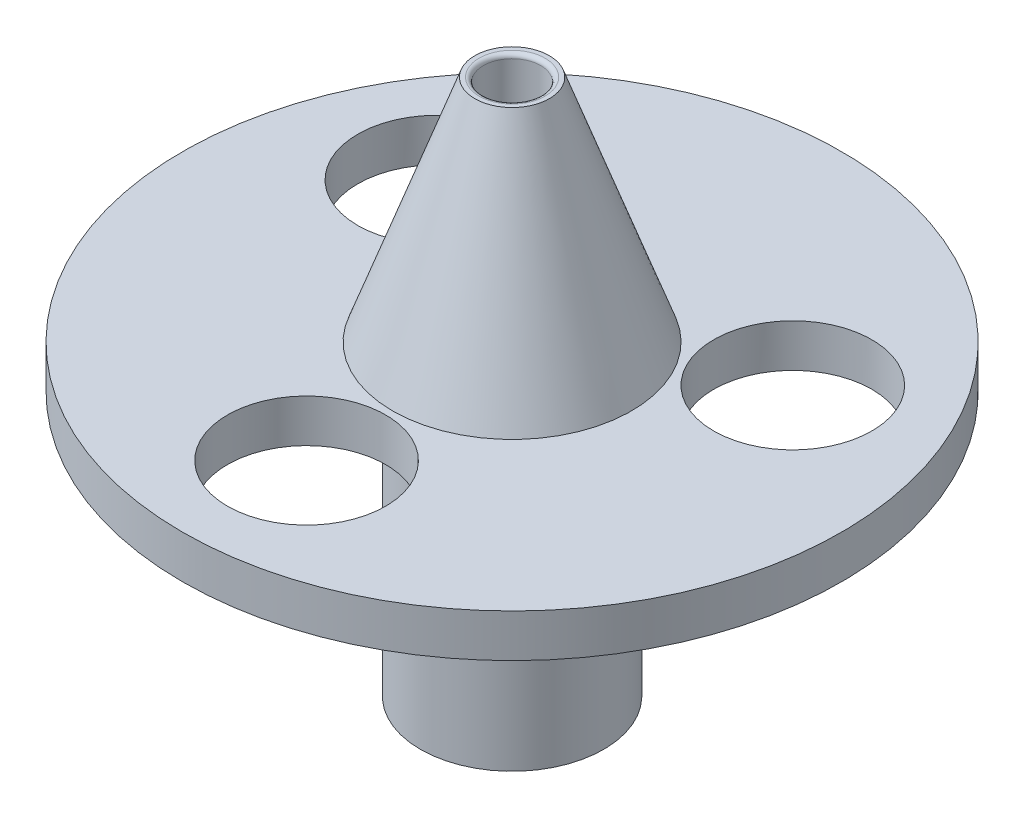
ISO-10303-21;
HEADER;
FILE_DESCRIPTION(('STEP AP214'),'2;1');
FILE_NAME('part.step','',(''),(''),'','','');
FILE_SCHEMA(('AUTOMOTIVE_DESIGN { 1 0 10303 214 1 1 1 1 }'));
ENDSEC;
DATA;
#1=APPLICATION_CONTEXT('core data for automotive mechanical design processes');
#2=APPLICATION_PROTOCOL_DEFINITION('international standard','automotive_design',2000,#1);
#3=PRODUCT_CONTEXT('',#1,'mechanical');
#4=PRODUCT('Part','Part','',(#3));
#5=PRODUCT_RELATED_PRODUCT_CATEGORY('part','',(#4));
#6=PRODUCT_DEFINITION_FORMATION('','',#4);
#7=PRODUCT_DEFINITION_CONTEXT('part definition',#1,'design');
#8=PRODUCT_DEFINITION('design','',#6,#7);
#9=PRODUCT_DEFINITION_SHAPE('','',#8);
#10=(LENGTH_UNIT() NAMED_UNIT(*) SI_UNIT(.MILLI.,.METRE.));
#11=(NAMED_UNIT(*) PLANE_ANGLE_UNIT() SI_UNIT($,.RADIAN.));
#12=(NAMED_UNIT(*) SI_UNIT($,.STERADIAN.) SOLID_ANGLE_UNIT());
#13=UNCERTAINTY_MEASURE_WITH_UNIT(LENGTH_MEASURE(1.E-05),#10,'distance_accuracy_value','');
#14=(GEOMETRIC_REPRESENTATION_CONTEXT(3) GLOBAL_UNCERTAINTY_ASSIGNED_CONTEXT((#13)) GLOBAL_UNIT_ASSIGNED_CONTEXT((#10,
#11,#12)) REPRESENTATION_CONTEXT('',''));
#15=CARTESIAN_POINT('',(0.,0.,0.));
#16=DIRECTION('',(0.,0.,1.));
#17=DIRECTION('',(1.,0.,0.));
#18=AXIS2_PLACEMENT_3D('',#15,#16,#17);
#19=CARTESIAN_POINT('',(8.34090211798037,-16.,0.));
#20=DIRECTION('',(0.,1.,0.));
#21=DIRECTION('',(0.,0.,1.));
#22=AXIS2_PLACEMENT_3D('',#19,#20,#21);
#23=PLANE('',#22);
#24=CARTESIAN_POINT('',(0.,-16.,14.34090212));
#25=DIRECTION('',(0.,1.,0.));
#26=DIRECTION('',(0.,0.,1.));
#27=AXIS2_PLACEMENT_3D('',#24,#25,#26);
#28=CIRCLE('',#27,5.52);
#29=CARTESIAN_POINT('',(0.,-16.,19.86090212));
#30=VERTEX_POINT('',#29);
#31=EDGE_CURVE('E230',#30,#30,#28,.T.);
#32=ORIENTED_EDGE('',*,*,#31,.F.);
#33=EDGE_LOOP('',(#32));
#34=FACE_BOUND('',#33,.T.);
#35=CARTESIAN_POINT('',(0.,-16.,0.));
#36=DIRECTION('',(0.,1.,0.));
#37=DIRECTION('',(0.,0.,1.));
#38=AXIS2_PLACEMENT_3D('',#35,#36,#37);
#39=CIRCLE('',#38,8.34090211798037);
#40=CARTESIAN_POINT('',(0.,-16.,8.34090211798037));
#41=VERTEX_POINT('',#40);
#42=EDGE_CURVE('E107',#41,#41,#39,.T.);
#43=ORIENTED_EDGE('',*,*,#42,.F.);
#44=EDGE_LOOP('',(#43));
#45=FACE_BOUND('',#44,.T.);
#46=CARTESIAN_POINT('',(0.,-16.,0.));
#47=DIRECTION('',(0.,1.,0.));
#48=DIRECTION('',(0.,0.,1.));
#49=AXIS2_PLACEMENT_3D('',#46,#47,#48);
#50=CIRCLE('',#49,23.);
#51=CARTESIAN_POINT('',(0.,-16.,23.));
#52=VERTEX_POINT('',#51);
#53=EDGE_CURVE('E93',#52,#52,#50,.T.);
#54=ORIENTED_EDGE('',*,*,#53,.T.);
#55=EDGE_LOOP('',(#54));
#56=FACE_BOUND('',#55,.T.);
#57=CARTESIAN_POINT('',(12.4195855473576,-16.,-7.170451058991));
#58=DIRECTION('',(0.,1.,0.));
#59=DIRECTION('',(0.,0.,1.));
#60=AXIS2_PLACEMENT_3D('',#57,#58,#59);
#61=CIRCLE('',#60,5.52000000000096);
#62=CARTESIAN_POINT('',(12.4195855473576,-16.,-1.65045105899004));
#63=VERTEX_POINT('',#62);
#64=EDGE_CURVE('E76',#63,#63,#61,.T.);
#65=ORIENTED_EDGE('',*,*,#64,.F.);
#66=EDGE_LOOP('',(#65));
#67=FACE_BOUND('',#66,.T.);
#68=CARTESIAN_POINT('',(-12.4195855473571,-16.,-7.17045105899019));
#69=DIRECTION('',(0.,1.,0.));
#70=DIRECTION('',(0.,0.,1.));
#71=AXIS2_PLACEMENT_3D('',#68,#69,#70);
#72=CIRCLE('',#71,5.52);
#73=CARTESIAN_POINT('',(-12.4195855473571,-16.,-1.65045105899019));
#74=VERTEX_POINT('',#73);
#75=EDGE_CURVE('E84',#74,#74,#72,.T.);
#76=ORIENTED_EDGE('',*,*,#75,.F.);
#77=EDGE_LOOP('',(#76));
#78=FACE_BOUND('',#77,.T.);
#79=ADVANCED_FACE('F55',(#34,#45,#56,#67,#78),#23,.T.);
#80=CARTESIAN_POINT('',(20.3409021179804,-19.,0.));
#81=DIRECTION('',(0.,-1.,0.));
#82=DIRECTION('',(0.,0.,-1.));
#83=AXIS2_PLACEMENT_3D('',#80,#81,#82);
#84=PLANE('',#83);
#85=CARTESIAN_POINT('',(0.,-19.,14.34090212));
#86=DIRECTION('',(0.,1.,0.));
#87=DIRECTION('',(0.,0.,1.));
#88=AXIS2_PLACEMENT_3D('',#85,#86,#87);
#89=CIRCLE('',#88,5.52);
#90=CARTESIAN_POINT('',(0.,-19.,19.86090212));
#91=VERTEX_POINT('',#90);
#92=EDGE_CURVE('E228',#91,#91,#89,.T.);
#93=ORIENTED_EDGE('',*,*,#92,.T.);
#94=EDGE_LOOP('',(#93));
#95=FACE_BOUND('',#94,.T.);
#96=CARTESIAN_POINT('',(0.,-19.,0.));
#97=DIRECTION('',(0.,1.,0.));
#98=DIRECTION('',(0.,0.,1.));
#99=AXIS2_PLACEMENT_3D('',#96,#97,#98);
#100=CIRCLE('',#99,23.);
#101=CARTESIAN_POINT('',(0.,-19.,23.));
#102=VERTEX_POINT('',#101);
#103=EDGE_CURVE('E90',#102,#102,#100,.T.);
#104=ORIENTED_EDGE('',*,*,#103,.F.);
#105=EDGE_LOOP('',(#104));
#106=FACE_BOUND('',#105,.T.);
#107=CARTESIAN_POINT('',(0.,-19.,0.));
#108=DIRECTION('',(0.,1.,0.));
#109=DIRECTION('',(0.,0.,1.));
#110=AXIS2_PLACEMENT_3D('',#107,#108,#109);
#111=CIRCLE('',#110,6.4);
#112=CARTESIAN_POINT('',(0.,-19.,6.4));
#113=VERTEX_POINT('',#112);
#114=EDGE_CURVE('E103',#113,#113,#111,.T.);
#115=ORIENTED_EDGE('',*,*,#114,.T.);
#116=EDGE_LOOP('',(#115));
#117=FACE_BOUND('',#116,.T.);
#118=CARTESIAN_POINT('',(12.4195855473576,-19.,-7.170451058991));
#119=DIRECTION('',(0.,-1.,0.));
#120=DIRECTION('',(0.,0.,-1.));
#121=AXIS2_PLACEMENT_3D('',#118,#119,#120);
#122=CIRCLE('',#121,5.52000000000096);
#123=CARTESIAN_POINT('',(12.4195855473576,-19.,-12.690451058992));
#124=VERTEX_POINT('',#123);
#125=EDGE_CURVE('E73',#124,#124,#122,.T.);
#126=ORIENTED_EDGE('',*,*,#125,.F.);
#127=EDGE_LOOP('',(#126));
#128=FACE_BOUND('',#127,.T.);
#129=CARTESIAN_POINT('',(-12.4195855473571,-19.,-7.17045105899019));
#130=DIRECTION('',(0.,-1.,0.));
#131=DIRECTION('',(0.,0.,-1.));
#132=AXIS2_PLACEMENT_3D('',#129,#130,#131);
#133=CIRCLE('',#132,5.52);
#134=CARTESIAN_POINT('',(-12.4195855473571,-19.,-12.6904510589902));
#135=VERTEX_POINT('',#134);
#136=EDGE_CURVE('E59',#135,#135,#133,.T.);
#137=ORIENTED_EDGE('',*,*,#136,.F.);
#138=EDGE_LOOP('',(#137));
#139=FACE_BOUND('',#138,.T.);
#140=ADVANCED_FACE('F152',(#95,#106,#117,#128,#139),#84,.T.);
#141=CARTESIAN_POINT('',(0.,0.,0.));
#142=DIRECTION('',(0.,1.,0.));
#143=DIRECTION('',(0.,0.,1.));
#144=AXIS2_PLACEMENT_3D('',#141,#142,#143);
#145=CYLINDRICAL_SURFACE('',#144,2.);
#146=CARTESIAN_POINT('',(0.,-14.9277526967274,0.));
#147=DIRECTION('',(0.,-1.,0.));
#148=DIRECTION('',(0.,0.,-1.));
#149=AXIS2_PLACEMENT_3D('',#146,#147,#148);
#150=CIRCLE('',#149,2.);
#151=CARTESIAN_POINT('',(0.,-14.9277526967274,-2.));
#152=VERTEX_POINT('',#151);
#153=EDGE_CURVE('E70',#152,#152,#150,.T.);
#154=ORIENTED_EDGE('',*,*,#153,.T.);
#155=EDGE_LOOP('',(#154));
#156=FACE_BOUND('',#155,.T.);
#157=CARTESIAN_POINT('',(0.,-0.3,0.));
#158=DIRECTION('',(0.,1.,0.));
#159=DIRECTION('',(0.,0.,1.));
#160=AXIS2_PLACEMENT_3D('',#157,#158,#159);
#161=CIRCLE('',#160,2.);
#162=CARTESIAN_POINT('',(0.,-0.3,2.));
#163=VERTEX_POINT('',#162);
#164=EDGE_CURVE('E115',#163,#163,#161,.T.);
#165=ORIENTED_EDGE('',*,*,#164,.T.);
#166=EDGE_LOOP('',(#165));
#167=FACE_BOUND('',#166,.T.);
#168=ADVANCED_FACE('F130',(#156,#167),#145,.F.);
#169=CARTESIAN_POINT('',(2.,0.,0.));
#170=DIRECTION('',(0.,1.,0.));
#171=DIRECTION('',(0.,0.,1.));
#172=AXIS2_PLACEMENT_3D('',#169,#170,#171);
#173=PLANE('',#172);
#174=CARTESIAN_POINT('',(0.,0.,0.));
#175=DIRECTION('',(0.,1.,0.));
#176=DIRECTION('',(0.,0.,1.));
#177=AXIS2_PLACEMENT_3D('',#174,#175,#176);
#178=CIRCLE('',#177,2.3);
#179=CARTESIAN_POINT('',(0.,0.,2.3));
#180=VERTEX_POINT('',#179);
#181=EDGE_CURVE('E119',#180,#180,#178,.F.);
#182=ORIENTED_EDGE('',*,*,#181,.T.);
#183=EDGE_LOOP('',(#182));
#184=FACE_BOUND('',#183,.T.);
#185=CARTESIAN_POINT('',(0.,0.,0.));
#186=DIRECTION('',(0.,1.,0.));
#187=DIRECTION('',(0.,0.,1.));
#188=AXIS2_PLACEMENT_3D('',#185,#186,#187);
#189=CIRCLE('',#188,2.6);
#190=CARTESIAN_POINT('',(0.,0.,2.6));
#191=VERTEX_POINT('',#190);
#192=EDGE_CURVE('E111',#191,#191,#189,.T.);
#193=ORIENTED_EDGE('',*,*,#192,.T.);
#194=EDGE_LOOP('',(#193));
#195=FACE_BOUND('',#194,.T.);
#196=ADVANCED_FACE('F169',(#184,#195),#173,.T.);
#197=CARTESIAN_POINT('',(0.,0.,0.));
#198=DIRECTION('',(0.,-1.,0.));
#199=DIRECTION('',(0.,0.,-1.));
#200=AXIS2_PLACEMENT_3D('',#197,#198,#199);
#201=CONICAL_SURFACE('',#200,2.6,0.344498506034037);
#202=ORIENTED_EDGE('',*,*,#42,.T.);
#203=EDGE_LOOP('',(#202));
#204=FACE_BOUND('',#203,.T.);
#205=ORIENTED_EDGE('',*,*,#192,.F.);
#206=EDGE_LOOP('',(#205));
#207=FACE_BOUND('',#206,.T.);
#208=ADVANCED_FACE('F165',(#204,#207),#201,.T.);
#209=CARTESIAN_POINT('',(0.,0.,0.));
#210=DIRECTION('',(0.,1.,0.));
#211=DIRECTION('',(0.,0.,1.));
#212=AXIS2_PLACEMENT_3D('',#209,#210,#211);
#213=CYLINDRICAL_SURFACE('',#212,6.4);
#214=CARTESIAN_POINT('',(0.,-37.4277526967274,0.));
#215=DIRECTION('',(0.,1.,0.));
#216=DIRECTION('',(0.,0.,1.));
#217=AXIS2_PLACEMENT_3D('',#214,#215,#216);
#218=CIRCLE('',#217,6.4);
#219=CARTESIAN_POINT('',(0.,-37.4277526967274,6.4));
#220=VERTEX_POINT('',#219);
#221=EDGE_CURVE('E99',#220,#220,#218,.T.);
#222=ORIENTED_EDGE('',*,*,#221,.T.);
#223=EDGE_LOOP('',(#222));
#224=FACE_BOUND('',#223,.T.);
#225=ORIENTED_EDGE('',*,*,#114,.F.);
#226=EDGE_LOOP('',(#225));
#227=FACE_BOUND('',#226,.T.);
#228=ADVANCED_FACE('F168',(#224,#227),#213,.T.);
#229=CARTESIAN_POINT('',(3.4,-37.4277526967274,0.));
#230=DIRECTION('',(0.,1.,0.));
#231=DIRECTION('',(0.,0.,1.));
#232=AXIS2_PLACEMENT_3D('',#229,#230,#231);
#233=PLANE('',#232);
#234=CARTESIAN_POINT('',(0.,-37.4277526967274,0.));
#235=DIRECTION('',(0.,1.,0.));
#236=DIRECTION('',(0.,0.,1.));
#237=AXIS2_PLACEMENT_3D('',#234,#235,#236);
#238=CIRCLE('',#237,4.1);
#239=CARTESIAN_POINT('',(0.,-37.4277526967274,4.1));
#240=VERTEX_POINT('',#239);
#241=EDGE_CURVE('E64',#240,#240,#238,.T.);
#242=ORIENTED_EDGE('',*,*,#241,.T.);
#243=EDGE_LOOP('',(#242));
#244=FACE_BOUND('',#243,.T.);
#245=ORIENTED_EDGE('',*,*,#221,.F.);
#246=EDGE_LOOP('',(#245));
#247=FACE_BOUND('',#246,.T.);
#248=ADVANCED_FACE('F177',(#244,#247),#233,.F.);
#249=CARTESIAN_POINT('',(0.,-0.3,0.));
#250=DIRECTION('',(0.,1.,0.));
#251=DIRECTION('',(0.,0.,1.));
#252=AXIS2_PLACEMENT_3D('',#249,#250,#251);
#253=TOROIDAL_SURFACE('',#252,2.3,0.3);
#254=ORIENTED_EDGE('',*,*,#181,.F.);
#255=EDGE_LOOP('',(#254));
#256=FACE_BOUND('',#255,.T.);
#257=ORIENTED_EDGE('',*,*,#164,.F.);
#258=EDGE_LOOP('',(#257));
#259=FACE_BOUND('',#258,.T.);
#260=ADVANCED_FACE('F142',(#256,#259),#253,.T.);
#261=CARTESIAN_POINT('',(0.,-15.4277526967274,0.));
#262=DIRECTION('',(0.,-1.,0.));
#263=DIRECTION('',(0.,0.,-1.));
#264=AXIS2_PLACEMENT_3D('',#261,#262,#263);
#265=PLANE('',#264);
#266=CARTESIAN_POINT('',(0.,-15.4277526967274,0.));
#267=DIRECTION('',(0.,-1.,0.));
#268=DIRECTION('',(0.,0.,-1.));
#269=AXIS2_PLACEMENT_3D('',#266,#267,#268);
#270=CIRCLE('',#269,2.5);
#271=CARTESIAN_POINT('',(0.,-15.4277526967274,-2.5));
#272=VERTEX_POINT('',#271);
#273=EDGE_CURVE('E123',#272,#272,#270,.F.);
#274=ORIENTED_EDGE('',*,*,#273,.T.);
#275=EDGE_LOOP('',(#274));
#276=FACE_BOUND('',#275,.T.);
#277=CARTESIAN_POINT('',(0.,-15.4277526967274,0.));
#278=DIRECTION('',(0.,-1.,0.));
#279=DIRECTION('',(0.,0.,-1.));
#280=AXIS2_PLACEMENT_3D('',#277,#278,#279);
#281=CIRCLE('',#280,3.6);
#282=CARTESIAN_POINT('',(0.,-15.4277526967274,-3.6));
#283=VERTEX_POINT('',#282);
#284=EDGE_CURVE('E82',#283,#283,#281,.T.);
#285=ORIENTED_EDGE('',*,*,#284,.T.);
#286=EDGE_LOOP('',(#285));
#287=FACE_BOUND('',#286,.T.);
#288=ADVANCED_FACE('F139',(#276,#287),#265,.T.);
#289=CARTESIAN_POINT('',(0.,-15.4277526967274,0.));
#290=DIRECTION('',(0.,-1.,0.));
#291=DIRECTION('',(0.,0.,-1.));
#292=AXIS2_PLACEMENT_3D('',#289,#290,#291);
#293=CYLINDRICAL_SURFACE('',#292,3.6);
#294=CARTESIAN_POINT('',(0.,-36.9277526967274,0.));
#295=DIRECTION('',(0.,1.,0.));
#296=DIRECTION('',(0.,0.,1.));
#297=AXIS2_PLACEMENT_3D('',#294,#295,#296);
#298=CIRCLE('',#297,3.6);
#299=CARTESIAN_POINT('',(0.,-36.9277526967274,3.6));
#300=VERTEX_POINT('',#299);
#301=EDGE_CURVE('E11',#300,#300,#298,.F.);
#302=ORIENTED_EDGE('',*,*,#301,.T.);
#303=EDGE_LOOP('',(#302));
#304=FACE_BOUND('',#303,.T.);
#305=ORIENTED_EDGE('',*,*,#284,.F.);
#306=EDGE_LOOP('',(#305));
#307=FACE_BOUND('',#306,.T.);
#308=ADVANCED_FACE('F136',(#304,#307),#293,.F.);
#309=CARTESIAN_POINT('',(0.,-14.9277526967274,0.));
#310=DIRECTION('',(0.,-1.,0.));
#311=DIRECTION('',(0.,0.,-1.));
#312=AXIS2_PLACEMENT_3D('',#309,#310,#311);
#313=TOROIDAL_SURFACE('',#312,2.5,0.5);
#314=ORIENTED_EDGE('',*,*,#153,.F.);
#315=EDGE_LOOP('',(#314));
#316=FACE_BOUND('',#315,.T.);
#317=ORIENTED_EDGE('',*,*,#273,.F.);
#318=EDGE_LOOP('',(#317));
#319=FACE_BOUND('',#318,.T.);
#320=ADVANCED_FACE('F133',(#316,#319),#313,.T.);
#321=CARTESIAN_POINT('',(0.,-36.9277526967274,0.));
#322=DIRECTION('',(0.,1.,0.));
#323=DIRECTION('',(0.,0.,1.));
#324=AXIS2_PLACEMENT_3D('',#321,#322,#323);
#325=TOROIDAL_SURFACE('',#324,4.1,0.5);
#326=ORIENTED_EDGE('',*,*,#301,.F.);
#327=EDGE_LOOP('',(#326));
#328=FACE_BOUND('',#327,.T.);
#329=ORIENTED_EDGE('',*,*,#241,.F.);
#330=EDGE_LOOP('',(#329));
#331=FACE_BOUND('',#330,.T.);
#332=ADVANCED_FACE('F57',(#328,#331),#325,.T.);
#333=CARTESIAN_POINT('',(12.4195855473576,-26.,-7.170451058991));
#334=DIRECTION('',(0.,1.,0.));
#335=DIRECTION('',(0.,0.,1.));
#336=AXIS2_PLACEMENT_3D('',#333,#334,#335);
#337=CYLINDRICAL_SURFACE('',#336,5.52000000000096);
#338=ORIENTED_EDGE('',*,*,#125,.T.);
#339=EDGE_LOOP('',(#338));
#340=FACE_BOUND('',#339,.T.);
#341=ORIENTED_EDGE('',*,*,#64,.T.);
#342=EDGE_LOOP('',(#341));
#343=FACE_BOUND('',#342,.T.);
#344=ADVANCED_FACE('F208',(#340,#343),#337,.F.);
#345=CARTESIAN_POINT('',(-12.4195855473571,-26.,-7.17045105899019));
#346=DIRECTION('',(0.,1.,0.));
#347=DIRECTION('',(0.,0.,1.));
#348=AXIS2_PLACEMENT_3D('',#345,#346,#347);
#349=CYLINDRICAL_SURFACE('',#348,5.52);
#350=ORIENTED_EDGE('',*,*,#136,.T.);
#351=EDGE_LOOP('',(#350));
#352=FACE_BOUND('',#351,.T.);
#353=ORIENTED_EDGE('',*,*,#75,.T.);
#354=EDGE_LOOP('',(#353));
#355=FACE_BOUND('',#354,.T.);
#356=ADVANCED_FACE('F204',(#352,#355),#349,.F.);
#357=CARTESIAN_POINT('',(0.,-19.,0.));
#358=DIRECTION('',(0.,1.,0.));
#359=DIRECTION('',(0.,0.,1.));
#360=AXIS2_PLACEMENT_3D('',#357,#358,#359);
#361=CYLINDRICAL_SURFACE('',#360,23.);
#362=ORIENTED_EDGE('',*,*,#53,.F.);
#363=EDGE_LOOP('',(#362));
#364=FACE_BOUND('',#363,.T.);
#365=ORIENTED_EDGE('',*,*,#103,.T.);
#366=EDGE_LOOP('',(#365));
#367=FACE_BOUND('',#366,.T.);
#368=ADVANCED_FACE('F207',(#364,#367),#361,.T.);
#369=CARTESIAN_POINT('',(0.,-19.,14.34090212));
#370=DIRECTION('',(0.,1.,0.));
#371=DIRECTION('',(0.,0.,1.));
#372=AXIS2_PLACEMENT_3D('',#369,#370,#371);
#373=CYLINDRICAL_SURFACE('',#372,5.52);
#374=ORIENTED_EDGE('',*,*,#92,.F.);
#375=EDGE_LOOP('',(#374));
#376=FACE_BOUND('',#375,.T.);
#377=ORIENTED_EDGE('',*,*,#31,.T.);
#378=EDGE_LOOP('',(#377));
#379=FACE_BOUND('',#378,.T.);
#380=ADVANCED_FACE('F216',(#376,#379),#373,.F.);
#381=CLOSED_SHELL('',(#79,#140,#168,#196,#208,#228,#248,#260,#288,#308,#320,#332,#344,#356,#368,#380));
#382=MANIFOLD_SOLID_BREP('B2',#381);
#383=ADVANCED_BREP_SHAPE_REPRESENTATION('',(#18,#382),#14);
#384=SHAPE_DEFINITION_REPRESENTATION(#9,#383);
ENDSEC;
END-ISO-10303-21;
